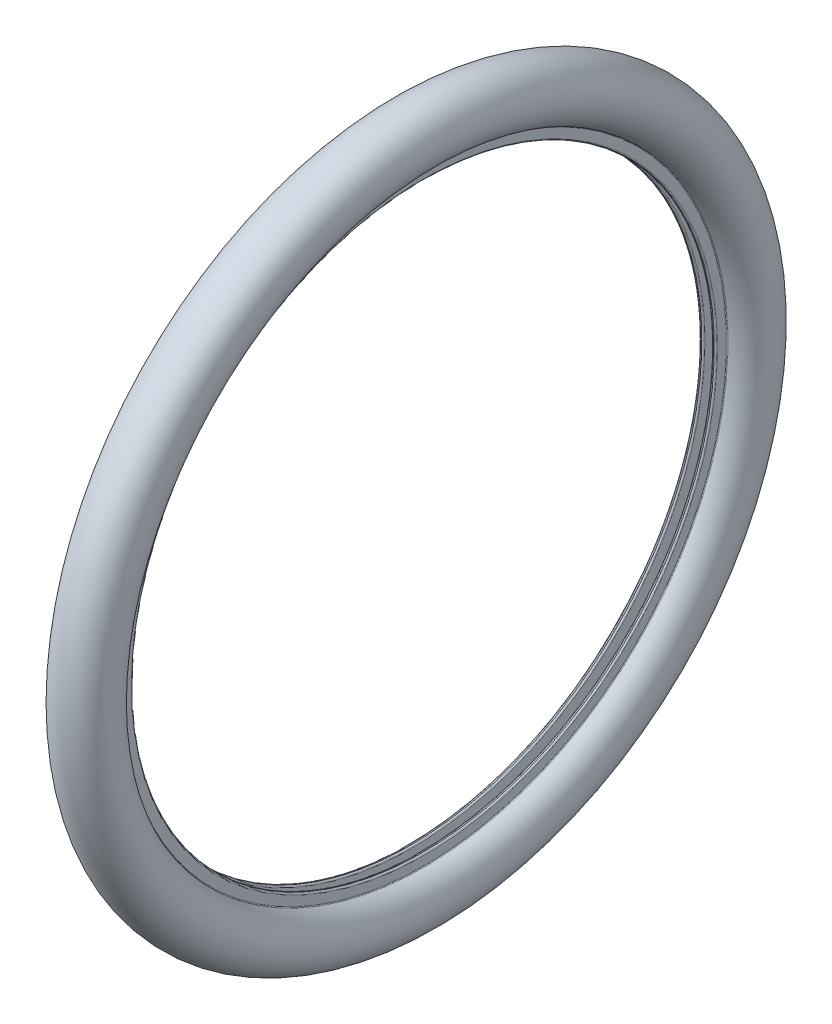
ISO-10303-21;
HEADER;
FILE_DESCRIPTION(('STEP AP214'),'2;1');
FILE_NAME('part.step','',(''),(''),'','','');
FILE_SCHEMA(('AUTOMOTIVE_DESIGN { 1 0 10303 214 1 1 1 1 }'));
ENDSEC;
DATA;
#1=APPLICATION_CONTEXT('core data for automotive mechanical design processes');
#2=APPLICATION_PROTOCOL_DEFINITION('international standard','automotive_design',2000,#1);
#3=PRODUCT_CONTEXT('',#1,'mechanical');
#4=PRODUCT('Part','Part','',(#3));
#5=PRODUCT_RELATED_PRODUCT_CATEGORY('part','',(#4));
#6=PRODUCT_DEFINITION_FORMATION('','',#4);
#7=PRODUCT_DEFINITION_CONTEXT('part definition',#1,'design');
#8=PRODUCT_DEFINITION('design','',#6,#7);
#9=PRODUCT_DEFINITION_SHAPE('','',#8);
#10=(LENGTH_UNIT() NAMED_UNIT(*) SI_UNIT(.MILLI.,.METRE.));
#11=(NAMED_UNIT(*) PLANE_ANGLE_UNIT() SI_UNIT($,.RADIAN.));
#12=(NAMED_UNIT(*) SI_UNIT($,.STERADIAN.) SOLID_ANGLE_UNIT());
#13=UNCERTAINTY_MEASURE_WITH_UNIT(LENGTH_MEASURE(1.E-05),#10,'distance_accuracy_value','');
#14=(GEOMETRIC_REPRESENTATION_CONTEXT(3) GLOBAL_UNCERTAINTY_ASSIGNED_CONTEXT((#13)) GLOBAL_UNIT_ASSIGNED_CONTEXT((#10,
#11,#12)) REPRESENTATION_CONTEXT('',''));
#15=CARTESIAN_POINT('',(0.,0.,0.));
#16=DIRECTION('',(0.,0.,1.));
#17=DIRECTION('',(1.,0.,0.));
#18=AXIS2_PLACEMENT_3D('',#15,#16,#17);
#19=CARTESIAN_POINT('',(0.,0.,0.));
#20=DIRECTION('',(-1.,0.,0.));
#21=DIRECTION('',(0.,0.,1.));
#22=AXIS2_PLACEMENT_3D('',#19,#20,#21);
#23=TOROIDAL_SURFACE('',#22,319.189528299502,19.5);
#24=CARTESIAN_POINT('',(8.,0.,0.));
#25=DIRECTION('',(-1.,0.,0.));
#26=DIRECTION('',(0.,0.,1.));
#27=AXIS2_PLACEMENT_3D('',#24,#25,#26);
#28=CIRCLE('',#27,301.406109055723);
#29=CARTESIAN_POINT('',(8.,0.,301.406109055723));
#30=VERTEX_POINT('',#29);
#31=EDGE_CURVE('E92',#30,#30,#28,.T.);
#32=ORIENTED_EDGE('',*,*,#31,.F.);
#33=EDGE_LOOP('',(#32));
#34=FACE_BOUND('',#33,.T.);
#35=CARTESIAN_POINT('',(-8.,0.,0.));
#36=DIRECTION('',(-1.,0.,0.));
#37=DIRECTION('',(0.,0.,1.));
#38=AXIS2_PLACEMENT_3D('',#35,#36,#37);
#39=CIRCLE('',#38,301.406109055723);
#40=CARTESIAN_POINT('',(-8.,0.,301.406109055723));
#41=VERTEX_POINT('',#40);
#42=EDGE_CURVE('E10',#41,#41,#39,.T.);
#43=ORIENTED_EDGE('',*,*,#42,.T.);
#44=EDGE_LOOP('',(#43));
#45=FACE_BOUND('',#44,.T.);
#46=ADVANCED_FACE('F34',(#34,#45),#23,.F.);
#47=CARTESIAN_POINT('',(-25.,0.,0.));
#48=DIRECTION('',(-1.,0.,0.));
#49=DIRECTION('',(0.,0.,1.));
#50=AXIS2_PLACEMENT_3D('',#47,#48,#49);
#51=CYLINDRICAL_SURFACE('',#50,301.406109055723);
#52=ORIENTED_EDGE('',*,*,#42,.F.);
#53=EDGE_LOOP('',(#52));
#54=FACE_BOUND('',#53,.T.);
#55=CARTESIAN_POINT('',(-7.49999999999998,0.,0.));
#56=DIRECTION('',(-1.,0.,0.));
#57=DIRECTION('',(0.,0.,1.));
#58=AXIS2_PLACEMENT_3D('',#55,#56,#57);
#59=CIRCLE('',#58,301.406109055723);
#60=CARTESIAN_POINT('',(-7.49999999999998,0.,301.406109055723));
#61=VERTEX_POINT('',#60);
#62=EDGE_CURVE('E40',#61,#61,#59,.T.);
#63=ORIENTED_EDGE('',*,*,#62,.T.);
#64=EDGE_LOOP('',(#63));
#65=FACE_BOUND('',#64,.T.);
#66=ADVANCED_FACE('F99',(#54,#65),#51,.T.);
#67=CARTESIAN_POINT('',(-7.49999999999998,0.,0.));
#68=DIRECTION('',(-1.,0.,0.));
#69=DIRECTION('',(0.,0.,1.));
#70=AXIS2_PLACEMENT_3D('',#67,#68,#69);
#71=TOROIDAL_SURFACE('',#70,297.906109055723,3.5);
#72=ORIENTED_EDGE('',*,*,#62,.F.);
#73=EDGE_LOOP('',(#72));
#74=FACE_BOUND('',#73,.T.);
#75=CARTESIAN_POINT('',(-3.99999999999998,0.,0.));
#76=DIRECTION('',(-1.,0.,0.));
#77=DIRECTION('',(0.,0.,1.));
#78=AXIS2_PLACEMENT_3D('',#75,#76,#77);
#79=CIRCLE('',#78,297.906109055723);
#80=CARTESIAN_POINT('',(-3.99999999999998,0.,297.906109055723));
#81=VERTEX_POINT('',#80);
#82=EDGE_CURVE('E44',#81,#81,#79,.T.);
#83=ORIENTED_EDGE('',*,*,#82,.T.);
#84=EDGE_LOOP('',(#83));
#85=FACE_BOUND('',#84,.T.);
#86=ADVANCED_FACE('F103',(#74,#85),#71,.T.);
#87=CARTESIAN_POINT('',(-3.99999999999998,283.5,0.));
#88=DIRECTION('',(-1.,0.,0.));
#89=DIRECTION('',(0.,0.,1.));
#90=AXIS2_PLACEMENT_3D('',#87,#88,#89);
#91=PLANE('',#90);
#92=ORIENTED_EDGE('',*,*,#82,.F.);
#93=EDGE_LOOP('',(#92));
#94=FACE_BOUND('',#93,.T.);
#95=CARTESIAN_POINT('',(-3.99999999999998,0.,0.));
#96=DIRECTION('',(-1.,0.,0.));
#97=DIRECTION('',(0.,0.,1.));
#98=AXIS2_PLACEMENT_3D('',#95,#96,#97);
#99=CIRCLE('',#98,283.5);
#100=CARTESIAN_POINT('',(-3.99999999999998,0.,283.5));
#101=VERTEX_POINT('',#100);
#102=EDGE_CURVE('E48',#101,#101,#99,.T.);
#103=ORIENTED_EDGE('',*,*,#102,.T.);
#104=EDGE_LOOP('',(#103));
#105=FACE_BOUND('',#104,.T.);
#106=ADVANCED_FACE('F108',(#94,#105),#91,.F.);
#107=CARTESIAN_POINT('',(-5.49999999999998,0.,0.));
#108=DIRECTION('',(-1.,0.,0.));
#109=DIRECTION('',(0.,0.,1.));
#110=AXIS2_PLACEMENT_3D('',#107,#108,#109);
#111=TOROIDAL_SURFACE('',#110,283.5,1.5);
#112=ORIENTED_EDGE('',*,*,#102,.F.);
#113=EDGE_LOOP('',(#112));
#114=FACE_BOUND('',#113,.T.);
#115=CARTESIAN_POINT('',(-5.49999999999998,0.,0.));
#116=DIRECTION('',(-1.,0.,0.));
#117=DIRECTION('',(0.,0.,1.));
#118=AXIS2_PLACEMENT_3D('',#115,#116,#117);
#119=CIRCLE('',#118,282.);
#120=CARTESIAN_POINT('',(-5.49999999999998,0.,282.));
#121=VERTEX_POINT('',#120);
#122=EDGE_CURVE('E53',#121,#121,#119,.T.);
#123=ORIENTED_EDGE('',*,*,#122,.T.);
#124=EDGE_LOOP('',(#123));
#125=FACE_BOUND('',#124,.T.);
#126=ADVANCED_FACE('F114',(#114,#125),#111,.T.);
#127=CARTESIAN_POINT('',(-25.,0.,0.));
#128=DIRECTION('',(-1.,0.,0.));
#129=DIRECTION('',(0.,0.,1.));
#130=AXIS2_PLACEMENT_3D('',#127,#128,#129);
#131=CYLINDRICAL_SURFACE('',#130,282.);
#132=ORIENTED_EDGE('',*,*,#122,.F.);
#133=EDGE_LOOP('',(#132));
#134=FACE_BOUND('',#133,.T.);
#135=CARTESIAN_POINT('',(-6.5,0.,0.));
#136=DIRECTION('',(-1.,0.,0.));
#137=DIRECTION('',(0.,0.,1.));
#138=AXIS2_PLACEMENT_3D('',#135,#136,#137);
#139=CIRCLE('',#138,282.);
#140=CARTESIAN_POINT('',(-6.5,0.,282.));
#141=VERTEX_POINT('',#140);
#142=EDGE_CURVE('E56',#141,#141,#139,.T.);
#143=ORIENTED_EDGE('',*,*,#142,.T.);
#144=EDGE_LOOP('',(#143));
#145=FACE_BOUND('',#144,.T.);
#146=ADVANCED_FACE('F118',(#134,#145),#131,.F.);
#147=CARTESIAN_POINT('',(-6.5,0.,0.));
#148=DIRECTION('',(-1.,0.,0.));
#149=DIRECTION('',(0.,0.,1.));
#150=AXIS2_PLACEMENT_3D('',#147,#148,#149);
#151=TOROIDAL_SURFACE('',#150,283.5,1.50000000000003);
#152=ORIENTED_EDGE('',*,*,#142,.F.);
#153=EDGE_LOOP('',(#152));
#154=FACE_BOUND('',#153,.T.);
#155=CARTESIAN_POINT('',(-8.00000000000003,0.,0.));
#156=DIRECTION('',(-1.,0.,0.));
#157=DIRECTION('',(0.,0.,1.));
#158=AXIS2_PLACEMENT_3D('',#155,#156,#157);
#159=CIRCLE('',#158,283.5);
#160=CARTESIAN_POINT('',(-8.00000000000003,0.,283.5));
#161=VERTEX_POINT('',#160);
#162=EDGE_CURVE('E59',#161,#161,#159,.T.);
#163=ORIENTED_EDGE('',*,*,#162,.T.);
#164=EDGE_LOOP('',(#163));
#165=FACE_BOUND('',#164,.T.);
#166=ADVANCED_FACE('F122',(#154,#165),#151,.T.);
#167=CARTESIAN_POINT('',(-8.00000000000001,292.218099487822,0.));
#168=DIRECTION('',(1.,0.,0.));
#169=DIRECTION('',(0.,0.,-1.));
#170=AXIS2_PLACEMENT_3D('',#167,#168,#169);
#171=PLANE('',#170);
#172=ORIENTED_EDGE('',*,*,#162,.F.);
#173=EDGE_LOOP('',(#172));
#174=FACE_BOUND('',#173,.T.);
#175=CARTESIAN_POINT('',(-8.,0.,0.));
#176=DIRECTION('',(-1.,0.,0.));
#177=DIRECTION('',(0.,0.,1.));
#178=AXIS2_PLACEMENT_3D('',#175,#176,#177);
#179=CIRCLE('',#178,292.218099487822);
#180=CARTESIAN_POINT('',(-8.,0.,292.218099487822));
#181=VERTEX_POINT('',#180);
#182=EDGE_CURVE('E62',#181,#181,#179,.T.);
#183=ORIENTED_EDGE('',*,*,#182,.T.);
#184=EDGE_LOOP('',(#183));
#185=FACE_BOUND('',#184,.T.);
#186=ADVANCED_FACE('F126',(#174,#185),#171,.F.);
#187=CARTESIAN_POINT('',(-8.90276851650059,0.,0.));
#188=DIRECTION('',(-1.,0.,0.));
#189=DIRECTION('',(0.,0.,1.));
#190=AXIS2_PLACEMENT_3D('',#187,#188,#189);
#191=TOROIDAL_SURFACE('',#190,292.218099487822,0.902768516500582);
#192=ORIENTED_EDGE('',*,*,#182,.F.);
#193=EDGE_LOOP('',(#192));
#194=FACE_BOUND('',#193,.T.);
#195=CARTESIAN_POINT('',(-8.61979824472162,0.,0.));
#196=DIRECTION('',(-1.,0.,0.));
#197=DIRECTION('',(0.,0.,1.));
#198=AXIS2_PLACEMENT_3D('',#195,#196,#197);
#199=CIRCLE('',#198,293.075373551161);
#200=CARTESIAN_POINT('',(-8.61979824472162,0.,293.075373551161));
#201=VERTEX_POINT('',#200);
#202=EDGE_CURVE('E65',#201,#201,#199,.T.);
#203=ORIENTED_EDGE('',*,*,#202,.T.);
#204=EDGE_LOOP('',(#203));
#205=FACE_BOUND('',#204,.T.);
#206=ADVANCED_FACE('F130',(#194,#205),#191,.F.);
#207=CARTESIAN_POINT('',(0.,0.,0.));
#208=DIRECTION('',(-1.,0.,0.));
#209=DIRECTION('',(0.,0.,1.));
#210=AXIS2_PLACEMENT_3D('',#207,#208,#209);
#211=TOROIDAL_SURFACE('',#210,319.189528299502,27.5);
#212=ORIENTED_EDGE('',*,*,#202,.F.);
#213=EDGE_LOOP('',(#212));
#214=FACE_BOUND('',#213,.T.);
#215=CARTESIAN_POINT('',(8.61979824472161,0.,0.));
#216=DIRECTION('',(-1.,0.,0.));
#217=DIRECTION('',(0.,0.,1.));
#218=AXIS2_PLACEMENT_3D('',#215,#216,#217);
#219=CIRCLE('',#218,293.075373551161);
#220=CARTESIAN_POINT('',(8.61979824472161,0.,293.075373551161));
#221=VERTEX_POINT('',#220);
#222=EDGE_CURVE('E68',#221,#221,#219,.T.);
#223=ORIENTED_EDGE('',*,*,#222,.T.);
#224=EDGE_LOOP('',(#223));
#225=FACE_BOUND('',#224,.T.);
#226=ADVANCED_FACE('F134',(#214,#225),#211,.T.);
#227=CARTESIAN_POINT('',(8.90276851650059,0.,0.));
#228=DIRECTION('',(-1.,0.,0.));
#229=DIRECTION('',(0.,0.,1.));
#230=AXIS2_PLACEMENT_3D('',#227,#228,#229);
#231=TOROIDAL_SURFACE('',#230,292.218099487822,0.902768516500582);
#232=ORIENTED_EDGE('',*,*,#222,.F.);
#233=EDGE_LOOP('',(#232));
#234=FACE_BOUND('',#233,.T.);
#235=CARTESIAN_POINT('',(8.00000000000001,0.,0.));
#236=DIRECTION('',(-1.,0.,0.));
#237=DIRECTION('',(0.,0.,1.));
#238=AXIS2_PLACEMENT_3D('',#235,#236,#237);
#239=CIRCLE('',#238,292.218099487822);
#240=CARTESIAN_POINT('',(8.00000000000001,0.,292.218099487822));
#241=VERTEX_POINT('',#240);
#242=EDGE_CURVE('E71',#241,#241,#239,.T.);
#243=ORIENTED_EDGE('',*,*,#242,.T.);
#244=EDGE_LOOP('',(#243));
#245=FACE_BOUND('',#244,.T.);
#246=ADVANCED_FACE('F138',(#234,#245),#231,.F.);
#247=CARTESIAN_POINT('',(8.,292.218099487822,0.));
#248=DIRECTION('',(-1.,0.,0.));
#249=DIRECTION('',(0.,0.,1.));
#250=AXIS2_PLACEMENT_3D('',#247,#248,#249);
#251=PLANE('',#250);
#252=ORIENTED_EDGE('',*,*,#242,.F.);
#253=EDGE_LOOP('',(#252));
#254=FACE_BOUND('',#253,.T.);
#255=CARTESIAN_POINT('',(8.,0.,0.));
#256=DIRECTION('',(-1.,0.,0.));
#257=DIRECTION('',(0.,0.,1.));
#258=AXIS2_PLACEMENT_3D('',#255,#256,#257);
#259=CIRCLE('',#258,283.5);
#260=CARTESIAN_POINT('',(8.,0.,283.5));
#261=VERTEX_POINT('',#260);
#262=EDGE_CURVE('E74',#261,#261,#259,.T.);
#263=ORIENTED_EDGE('',*,*,#262,.T.);
#264=EDGE_LOOP('',(#263));
#265=FACE_BOUND('',#264,.T.);
#266=ADVANCED_FACE('F142',(#254,#265),#251,.F.);
#267=CARTESIAN_POINT('',(6.5,0.,0.));
#268=DIRECTION('',(-1.,0.,0.));
#269=DIRECTION('',(0.,0.,1.));
#270=AXIS2_PLACEMENT_3D('',#267,#268,#269);
#271=TOROIDAL_SURFACE('',#270,283.5,1.5);
#272=ORIENTED_EDGE('',*,*,#262,.F.);
#273=EDGE_LOOP('',(#272));
#274=FACE_BOUND('',#273,.T.);
#275=CARTESIAN_POINT('',(6.5,0.,0.));
#276=DIRECTION('',(-1.,0.,0.));
#277=DIRECTION('',(0.,0.,1.));
#278=AXIS2_PLACEMENT_3D('',#275,#276,#277);
#279=CIRCLE('',#278,282.);
#280=CARTESIAN_POINT('',(6.5,0.,282.));
#281=VERTEX_POINT('',#280);
#282=EDGE_CURVE('E77',#281,#281,#279,.T.);
#283=ORIENTED_EDGE('',*,*,#282,.T.);
#284=EDGE_LOOP('',(#283));
#285=FACE_BOUND('',#284,.T.);
#286=ADVANCED_FACE('F146',(#274,#285),#271,.T.);
#287=CARTESIAN_POINT('',(-25.,0.,0.));
#288=DIRECTION('',(-1.,0.,0.));
#289=DIRECTION('',(0.,0.,1.));
#290=AXIS2_PLACEMENT_3D('',#287,#288,#289);
#291=CYLINDRICAL_SURFACE('',#290,282.);
#292=ORIENTED_EDGE('',*,*,#282,.F.);
#293=EDGE_LOOP('',(#292));
#294=FACE_BOUND('',#293,.T.);
#295=CARTESIAN_POINT('',(5.49999999999998,0.,0.));
#296=DIRECTION('',(-1.,0.,0.));
#297=DIRECTION('',(0.,0.,1.));
#298=AXIS2_PLACEMENT_3D('',#295,#296,#297);
#299=CIRCLE('',#298,282.);
#300=CARTESIAN_POINT('',(5.49999999999998,0.,282.));
#301=VERTEX_POINT('',#300);
#302=EDGE_CURVE('E80',#301,#301,#299,.T.);
#303=ORIENTED_EDGE('',*,*,#302,.T.);
#304=EDGE_LOOP('',(#303));
#305=FACE_BOUND('',#304,.T.);
#306=ADVANCED_FACE('F150',(#294,#305),#291,.F.);
#307=CARTESIAN_POINT('',(5.49999999999998,0.,0.));
#308=DIRECTION('',(-1.,0.,0.));
#309=DIRECTION('',(0.,0.,1.));
#310=AXIS2_PLACEMENT_3D('',#307,#308,#309);
#311=TOROIDAL_SURFACE('',#310,283.5,1.5);
#312=ORIENTED_EDGE('',*,*,#302,.F.);
#313=EDGE_LOOP('',(#312));
#314=FACE_BOUND('',#313,.T.);
#315=CARTESIAN_POINT('',(3.99999999999998,0.,0.));
#316=DIRECTION('',(-1.,0.,0.));
#317=DIRECTION('',(0.,0.,1.));
#318=AXIS2_PLACEMENT_3D('',#315,#316,#317);
#319=CIRCLE('',#318,283.5);
#320=CARTESIAN_POINT('',(3.99999999999998,0.,283.5));
#321=VERTEX_POINT('',#320);
#322=EDGE_CURVE('E83',#321,#321,#319,.T.);
#323=ORIENTED_EDGE('',*,*,#322,.T.);
#324=EDGE_LOOP('',(#323));
#325=FACE_BOUND('',#324,.T.);
#326=ADVANCED_FACE('F154',(#314,#325),#311,.T.);
#327=CARTESIAN_POINT('',(3.99999999999998,283.5,0.));
#328=DIRECTION('',(1.,0.,0.));
#329=DIRECTION('',(0.,0.,-1.));
#330=AXIS2_PLACEMENT_3D('',#327,#328,#329);
#331=PLANE('',#330);
#332=ORIENTED_EDGE('',*,*,#322,.F.);
#333=EDGE_LOOP('',(#332));
#334=FACE_BOUND('',#333,.T.);
#335=CARTESIAN_POINT('',(3.99999999999998,0.,0.));
#336=DIRECTION('',(-1.,0.,0.));
#337=DIRECTION('',(0.,0.,1.));
#338=AXIS2_PLACEMENT_3D('',#335,#336,#337);
#339=CIRCLE('',#338,297.906109055723);
#340=CARTESIAN_POINT('',(3.99999999999998,0.,297.906109055723));
#341=VERTEX_POINT('',#340);
#342=EDGE_CURVE('E86',#341,#341,#339,.T.);
#343=ORIENTED_EDGE('',*,*,#342,.T.);
#344=EDGE_LOOP('',(#343));
#345=FACE_BOUND('',#344,.T.);
#346=ADVANCED_FACE('F158',(#334,#345),#331,.F.);
#347=CARTESIAN_POINT('',(7.49999999999998,0.,0.));
#348=DIRECTION('',(-1.,0.,0.));
#349=DIRECTION('',(0.,0.,1.));
#350=AXIS2_PLACEMENT_3D('',#347,#348,#349);
#351=TOROIDAL_SURFACE('',#350,297.906109055723,3.5);
#352=ORIENTED_EDGE('',*,*,#342,.F.);
#353=EDGE_LOOP('',(#352));
#354=FACE_BOUND('',#353,.T.);
#355=CARTESIAN_POINT('',(7.49999999999998,0.,0.));
#356=DIRECTION('',(-1.,0.,0.));
#357=DIRECTION('',(0.,0.,1.));
#358=AXIS2_PLACEMENT_3D('',#355,#356,#357);
#359=CIRCLE('',#358,301.406109055723);
#360=CARTESIAN_POINT('',(7.49999999999998,0.,301.406109055723));
#361=VERTEX_POINT('',#360);
#362=EDGE_CURVE('E89',#361,#361,#359,.T.);
#363=ORIENTED_EDGE('',*,*,#362,.T.);
#364=EDGE_LOOP('',(#363));
#365=FACE_BOUND('',#364,.T.);
#366=ADVANCED_FACE('F162',(#354,#365),#351,.T.);
#367=CARTESIAN_POINT('',(-25.,0.,0.));
#368=DIRECTION('',(-1.,0.,0.));
#369=DIRECTION('',(0.,0.,1.));
#370=AXIS2_PLACEMENT_3D('',#367,#368,#369);
#371=CYLINDRICAL_SURFACE('',#370,301.406109055723);
#372=ORIENTED_EDGE('',*,*,#362,.F.);
#373=EDGE_LOOP('',(#372));
#374=FACE_BOUND('',#373,.T.);
#375=ORIENTED_EDGE('',*,*,#31,.T.);
#376=EDGE_LOOP('',(#375));
#377=FACE_BOUND('',#376,.T.);
#378=ADVANCED_FACE('F96',(#374,#377),#371,.T.);
#379=CLOSED_SHELL('',(#46,#66,#86,#106,#126,#146,#166,#186,#206,#226,#246,#266,#286,#306,#326,
#346,#366,#378));
#380=MANIFOLD_SOLID_BREP('B2',#379);
#381=ADVANCED_BREP_SHAPE_REPRESENTATION('',(#18,#380),#14);
#382=SHAPE_DEFINITION_REPRESENTATION(#9,#381);
ENDSEC;
END-ISO-10303-21;
